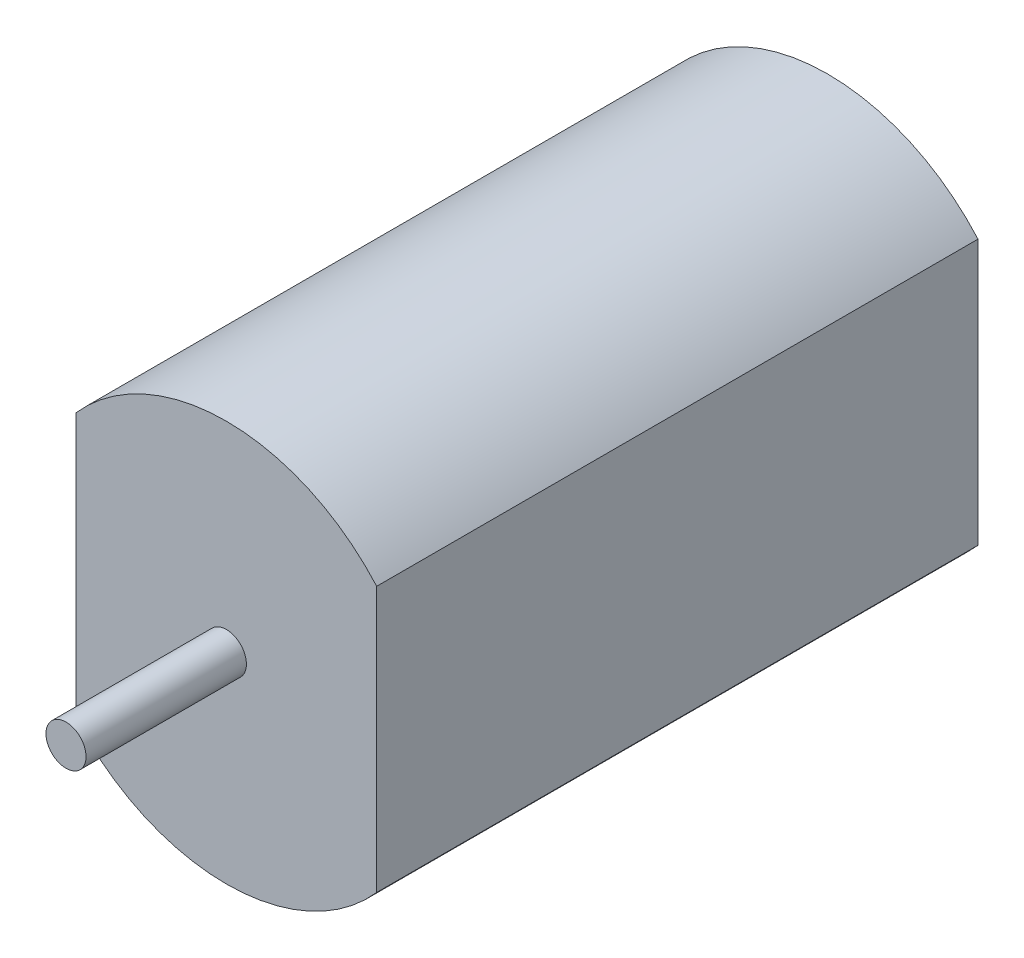
ISO-10303-21;
HEADER;
FILE_DESCRIPTION(('STEP AP214'),'2;1');
FILE_NAME('part.step','',(''),(''),'','','');
FILE_SCHEMA(('AUTOMOTIVE_DESIGN { 1 0 10303 214 1 1 1 1 }'));
ENDSEC;
DATA;
#1=APPLICATION_CONTEXT('core data for automotive mechanical design processes');
#2=APPLICATION_PROTOCOL_DEFINITION('international standard','automotive_design',2000,#1);
#3=PRODUCT_CONTEXT('',#1,'mechanical');
#4=PRODUCT('Part','Part','',(#3));
#5=PRODUCT_RELATED_PRODUCT_CATEGORY('part','',(#4));
#6=PRODUCT_DEFINITION_FORMATION('','',#4);
#7=PRODUCT_DEFINITION_CONTEXT('part definition',#1,'design');
#8=PRODUCT_DEFINITION('design','',#6,#7);
#9=PRODUCT_DEFINITION_SHAPE('','',#8);
#10=(LENGTH_UNIT() NAMED_UNIT(*) SI_UNIT(.MILLI.,.METRE.));
#11=(NAMED_UNIT(*) PLANE_ANGLE_UNIT() SI_UNIT($,.RADIAN.));
#12=(NAMED_UNIT(*) SI_UNIT($,.STERADIAN.) SOLID_ANGLE_UNIT());
#13=UNCERTAINTY_MEASURE_WITH_UNIT(LENGTH_MEASURE(1.E-05),#10,'distance_accuracy_value','');
#14=(GEOMETRIC_REPRESENTATION_CONTEXT(3) GLOBAL_UNCERTAINTY_ASSIGNED_CONTEXT((#13)) GLOBAL_UNIT_ASSIGNED_CONTEXT((#10,
#11,#12)) REPRESENTATION_CONTEXT('',''));
#15=CARTESIAN_POINT('',(0.,0.,0.));
#16=DIRECTION('',(0.,0.,1.));
#17=DIRECTION('',(1.,0.,0.));
#18=AXIS2_PLACEMENT_3D('',#15,#16,#17);
#19=CARTESIAN_POINT('',(0.,0.,30.));
#20=DIRECTION('',(0.,0.,-1.));
#21=DIRECTION('',(-1.,0.,0.));
#22=AXIS2_PLACEMENT_3D('',#19,#20,#21);
#23=CYLINDRICAL_SURFACE('',#22,10.);
#24=CARTESIAN_POINT('',(0.,0.,30.));
#25=DIRECTION('',(0.,0.,1.));
#26=DIRECTION('',(1.,0.,0.));
#27=AXIS2_PLACEMENT_3D('',#24,#25,#26);
#28=CIRCLE('',#27,10.);
#29=CARTESIAN_POINT('',(7.5,6.61437827766147,30.));
#30=VERTEX_POINT('',#29);
#31=CARTESIAN_POINT('',(-7.5,6.61437827766147,30.));
#32=VERTEX_POINT('',#31);
#33=EDGE_CURVE('E11',#30,#32,#28,.T.);
#34=ORIENTED_EDGE('',*,*,#33,.F.);
#35=DIRECTION('',(0.,0.,1.));
#36=VECTOR('',#35,1.);
#37=CARTESIAN_POINT('',(7.5,6.61437827766147,0.));
#38=LINE('',#37,#36);
#39=CARTESIAN_POINT('',(7.5,6.61437827766147,0.));
#40=VERTEX_POINT('',#39);
#41=EDGE_CURVE('E79',#40,#30,#38,.T.);
#42=ORIENTED_EDGE('',*,*,#41,.F.);
#43=CARTESIAN_POINT('',(0.,0.,0.));
#44=DIRECTION('',(0.,0.,1.));
#45=DIRECTION('',(1.,0.,0.));
#46=AXIS2_PLACEMENT_3D('',#43,#44,#45);
#47=CIRCLE('',#46,10.);
#48=CARTESIAN_POINT('',(-7.5,6.61437827766147,0.));
#49=VERTEX_POINT('',#48);
#50=EDGE_CURVE('E42',#40,#49,#47,.T.);
#51=ORIENTED_EDGE('',*,*,#50,.T.);
#52=DIRECTION('',(0.,0.,1.));
#53=VECTOR('',#52,1.);
#54=CARTESIAN_POINT('',(-7.5,6.61437827766147,0.));
#55=LINE('',#54,#53);
#56=EDGE_CURVE('E63',#49,#32,#55,.T.);
#57=ORIENTED_EDGE('',*,*,#56,.T.);
#58=EDGE_LOOP('',(#34,#42,#51,#57));
#59=FACE_BOUND('',#58,.T.);
#60=ADVANCED_FACE('F39',(#59),#23,.T.);
#61=CARTESIAN_POINT('',(-7.5,-6.61437827766148,0.));
#62=VERTEX_POINT('',#61);
#63=CARTESIAN_POINT('',(7.5,-6.61437827766147,0.));
#64=VERTEX_POINT('',#63);
#65=EDGE_CURVE('E111',#62,#64,#47,.T.);
#66=ORIENTED_EDGE('',*,*,#65,.T.);
#67=DIRECTION('',(0.,0.,1.));
#68=VECTOR('',#67,1.);
#69=CARTESIAN_POINT('',(7.5,-6.61437827766147,0.));
#70=LINE('',#69,#68);
#71=CARTESIAN_POINT('',(7.5,-6.61437827766147,30.));
#72=VERTEX_POINT('',#71);
#73=EDGE_CURVE('E55',#64,#72,#70,.T.);
#74=ORIENTED_EDGE('',*,*,#73,.T.);
#75=CARTESIAN_POINT('',(-7.5,-6.61437827766148,30.));
#76=VERTEX_POINT('',#75);
#77=EDGE_CURVE('E48',#76,#72,#28,.T.);
#78=ORIENTED_EDGE('',*,*,#77,.F.);
#79=DIRECTION('',(0.,0.,1.));
#80=VECTOR('',#79,1.);
#81=CARTESIAN_POINT('',(-7.5,-6.61437827766148,0.));
#82=LINE('',#81,#80);
#83=EDGE_CURVE('E96',#62,#76,#82,.T.);
#84=ORIENTED_EDGE('',*,*,#83,.F.);
#85=EDGE_LOOP('',(#66,#74,#78,#84));
#86=FACE_BOUND('',#85,.T.);
#87=ADVANCED_FACE('F133',(#86),#23,.T.);
#88=CARTESIAN_POINT('',(0.,0.,30.));
#89=DIRECTION('',(0.,0.,1.));
#90=DIRECTION('',(1.,0.,0.));
#91=AXIS2_PLACEMENT_3D('',#88,#89,#90);
#92=PLANE('',#91);
#93=CARTESIAN_POINT('',(0.,0.,30.));
#94=DIRECTION('',(0.,0.,1.));
#95=DIRECTION('',(1.,0.,0.));
#96=AXIS2_PLACEMENT_3D('',#93,#94,#95);
#97=CIRCLE('',#96,1.);
#98=CARTESIAN_POINT('',(1.,0.,30.));
#99=VERTEX_POINT('',#98);
#100=EDGE_CURVE('E115',#99,#99,#97,.T.);
#101=ORIENTED_EDGE('',*,*,#100,.F.);
#102=EDGE_LOOP('',(#101));
#103=FACE_BOUND('',#102,.T.);
#104=DIRECTION('',(0.,-1.,0.));
#105=VECTOR('',#104,1.);
#106=CARTESIAN_POINT('',(7.5,0.,30.));
#107=LINE('',#106,#105);
#108=EDGE_CURVE('E82',#30,#72,#107,.T.);
#109=ORIENTED_EDGE('',*,*,#108,.F.);
#110=ORIENTED_EDGE('',*,*,#33,.T.);
#111=DIRECTION('',(0.,-1.,0.));
#112=VECTOR('',#111,1.);
#113=CARTESIAN_POINT('',(-7.5,0.,30.));
#114=LINE('',#113,#112);
#115=EDGE_CURVE('E104',#32,#76,#114,.T.);
#116=ORIENTED_EDGE('',*,*,#115,.T.);
#117=ORIENTED_EDGE('',*,*,#77,.T.);
#118=EDGE_LOOP('',(#109,#110,#116,#117));
#119=FACE_BOUND('',#118,.T.);
#120=ADVANCED_FACE('F92',(#103,#119),#92,.T.);
#121=CARTESIAN_POINT('',(0.,0.,0.));
#122=DIRECTION('',(0.,0.,1.));
#123=DIRECTION('',(1.,0.,0.));
#124=AXIS2_PLACEMENT_3D('',#121,#122,#123);
#125=PLANE('',#124);
#126=ORIENTED_EDGE('',*,*,#50,.F.);
#127=DIRECTION('',(0.,-1.,0.));
#128=VECTOR('',#127,1.);
#129=CARTESIAN_POINT('',(7.5,0.,0.));
#130=LINE('',#129,#128);
#131=EDGE_CURVE('E83',#40,#64,#130,.T.);
#132=ORIENTED_EDGE('',*,*,#131,.T.);
#133=ORIENTED_EDGE('',*,*,#65,.F.);
#134=DIRECTION('',(0.,-1.,0.));
#135=VECTOR('',#134,1.);
#136=CARTESIAN_POINT('',(-7.5,0.,0.));
#137=LINE('',#136,#135);
#138=EDGE_CURVE('E99',#49,#62,#137,.T.);
#139=ORIENTED_EDGE('',*,*,#138,.F.);
#140=EDGE_LOOP('',(#126,#132,#133,#139));
#141=FACE_BOUND('',#140,.T.);
#142=ADVANCED_FACE('F132',(#141),#125,.F.);
#143=CARTESIAN_POINT('',(-7.5,0.,0.));
#144=DIRECTION('',(-1.,0.,0.));
#145=DIRECTION('',(0.,-1.,0.));
#146=AXIS2_PLACEMENT_3D('',#143,#144,#145);
#147=PLANE('',#146);
#148=ORIENTED_EDGE('',*,*,#115,.F.);
#149=ORIENTED_EDGE('',*,*,#56,.F.);
#150=ORIENTED_EDGE('',*,*,#138,.T.);
#151=ORIENTED_EDGE('',*,*,#83,.T.);
#152=EDGE_LOOP('',(#148,#149,#150,#151));
#153=FACE_BOUND('',#152,.T.);
#154=ADVANCED_FACE('F139',(#153),#147,.T.);
#155=CARTESIAN_POINT('',(7.5,0.,0.));
#156=DIRECTION('',(-1.,0.,0.));
#157=DIRECTION('',(0.,-1.,0.));
#158=AXIS2_PLACEMENT_3D('',#155,#156,#157);
#159=PLANE('',#158);
#160=ORIENTED_EDGE('',*,*,#108,.T.);
#161=ORIENTED_EDGE('',*,*,#73,.F.);
#162=ORIENTED_EDGE('',*,*,#131,.F.);
#163=ORIENTED_EDGE('',*,*,#41,.T.);
#164=EDGE_LOOP('',(#160,#161,#162,#163));
#165=FACE_BOUND('',#164,.T.);
#166=ADVANCED_FACE('F81',(#165),#159,.F.);
#167=CARTESIAN_POINT('',(0.,0.,38.));
#168=DIRECTION('',(0.,0.,-1.));
#169=DIRECTION('',(-1.,0.,0.));
#170=AXIS2_PLACEMENT_3D('',#167,#168,#169);
#171=CYLINDRICAL_SURFACE('',#170,1.);
#172=CARTESIAN_POINT('',(0.,0.,38.));
#173=DIRECTION('',(0.,0.,1.));
#174=DIRECTION('',(1.,0.,0.));
#175=AXIS2_PLACEMENT_3D('',#172,#173,#174);
#176=CIRCLE('',#175,1.);
#177=CARTESIAN_POINT('',(1.,0.,38.));
#178=VERTEX_POINT('',#177);
#179=EDGE_CURVE('E108',#178,#178,#176,.T.);
#180=ORIENTED_EDGE('',*,*,#179,.F.);
#181=EDGE_LOOP('',(#180));
#182=FACE_BOUND('',#181,.T.);
#183=ORIENTED_EDGE('',*,*,#100,.T.);
#184=EDGE_LOOP('',(#183));
#185=FACE_BOUND('',#184,.T.);
#186=ADVANCED_FACE('F125',(#182,#185),#171,.T.);
#187=CARTESIAN_POINT('',(0.,0.,38.));
#188=DIRECTION('',(0.,0.,1.));
#189=DIRECTION('',(1.,0.,0.));
#190=AXIS2_PLACEMENT_3D('',#187,#188,#189);
#191=PLANE('',#190);
#192=ORIENTED_EDGE('',*,*,#179,.T.);
#193=EDGE_LOOP('',(#192));
#194=FACE_BOUND('',#193,.T.);
#195=ADVANCED_FACE('F123',(#194),#191,.T.);
#196=CLOSED_SHELL('',(#60,#87,#120,#142,#154,#166,#186,#195));
#197=MANIFOLD_SOLID_BREP('B2',#196);
#198=ADVANCED_BREP_SHAPE_REPRESENTATION('',(#18,#197),#14);
#199=SHAPE_DEFINITION_REPRESENTATION(#9,#198);
ENDSEC;
END-ISO-10303-21;
